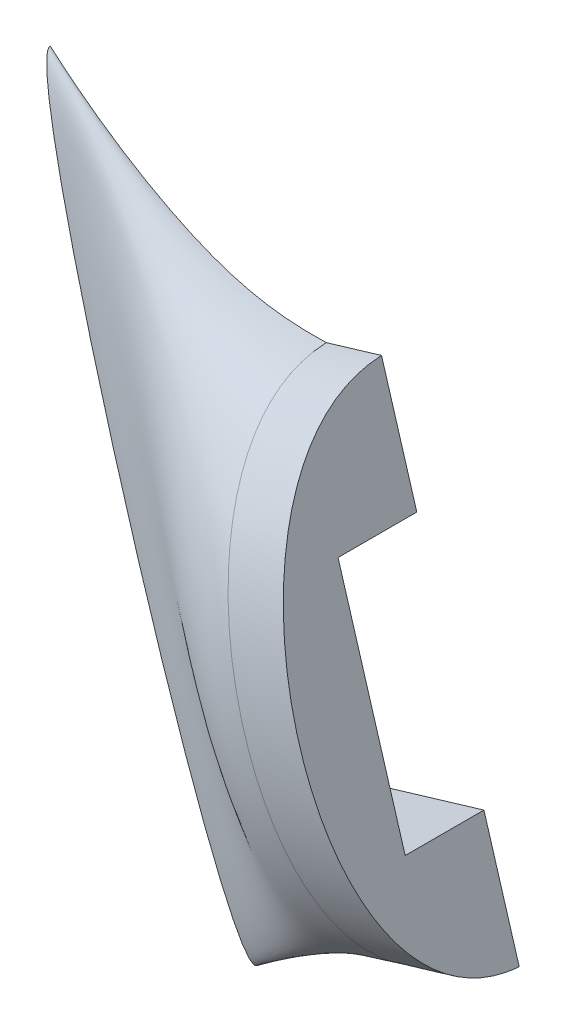
ISO-10303-21;
HEADER;
FILE_DESCRIPTION(('STEP AP214'),'2;1');
FILE_NAME('part.step','',(''),(''),'','','');
FILE_SCHEMA(('AUTOMOTIVE_DESIGN { 1 0 10303 214 1 1 1 1 }'));
ENDSEC;
DATA;
#1=APPLICATION_CONTEXT('core data for automotive mechanical design processes');
#2=APPLICATION_PROTOCOL_DEFINITION('international standard','automotive_design',2000,#1);
#3=PRODUCT_CONTEXT('',#1,'mechanical');
#4=PRODUCT('Part','Part','',(#3));
#5=PRODUCT_RELATED_PRODUCT_CATEGORY('part','',(#4));
#6=PRODUCT_DEFINITION_FORMATION('','',#4);
#7=PRODUCT_DEFINITION_CONTEXT('part definition',#1,'design');
#8=PRODUCT_DEFINITION('design','',#6,#7);
#9=PRODUCT_DEFINITION_SHAPE('','',#8);
#10=(LENGTH_UNIT() NAMED_UNIT(*) SI_UNIT(.MILLI.,.METRE.));
#11=(NAMED_UNIT(*) PLANE_ANGLE_UNIT() SI_UNIT($,.RADIAN.));
#12=(NAMED_UNIT(*) SI_UNIT($,.STERADIAN.) SOLID_ANGLE_UNIT());
#13=UNCERTAINTY_MEASURE_WITH_UNIT(LENGTH_MEASURE(1.E-05),#10,'distance_accuracy_value','');
#14=(GEOMETRIC_REPRESENTATION_CONTEXT(3) GLOBAL_UNCERTAINTY_ASSIGNED_CONTEXT((#13)) GLOBAL_UNIT_ASSIGNED_CONTEXT((#10,
#11,#12)) REPRESENTATION_CONTEXT('',''));
#15=CARTESIAN_POINT('',(0.,0.,0.));
#16=DIRECTION('',(0.,0.,1.));
#17=DIRECTION('',(1.,0.,0.));
#18=AXIS2_PLACEMENT_3D('',#15,#16,#17);
#19=CARTESIAN_POINT('',(68.8351354727939,20.5796630643947,0.));
#20=DIRECTION('',(0.,0.,1.));
#21=DIRECTION('',(-1.,0.,0.));
#22=AXIS2_PLACEMENT_3D('',#19,#20,#21);
#23=PLANE('',#22);
#24=DIRECTION('',(0.28644268795493,-0.958097378410543,0.));
#25=VECTOR('',#24,1.);
#26=CARTESIAN_POINT('',(75.1754818984992,-8.30803292728945,0.));
#27=LINE('',#26,#25);
#28=CARTESIAN_POINT('',(71.680881105449,3.38075508931917,0.));
#29=VERTEX_POINT('',#28);
#30=CARTESIAN_POINT('',(75.1754818984992,-8.30803292728945,0.));
#31=VERTEX_POINT('',#30);
#32=EDGE_CURVE('E115',#29,#31,#27,.T.);
#33=ORIENTED_EDGE('',*,*,#32,.T.);
#34=DIRECTION('',(0.958097378410543,0.28644268795493,0.));
#35=VECTOR('',#34,1.);
#36=CARTESIAN_POINT('',(75.1754818984992,-8.30803292728945,0.));
#37=LINE('',#36,#35);
#38=CARTESIAN_POINT('',(80.157588266234,-6.81853094992381,0.));
#39=VERTEX_POINT('',#38);
#40=EDGE_CURVE('E120',#31,#39,#37,.T.);
#41=ORIENTED_EDGE('',*,*,#40,.T.);
#42=DIRECTION('',(-0.28644268795493,0.958097378410543,0.));
#43=VECTOR('',#42,1.);
#44=CARTESIAN_POINT('',(71.7094276080255,21.4389911282595,0.));
#45=LINE('',#44,#43);
#46=CARTESIAN_POINT('',(81.9945436836104,-12.9628042850572,0.));
#47=VERTEX_POINT('',#46);
#48=EDGE_CURVE('E224',#47,#39,#45,.T.);
#49=ORIENTED_EDGE('',*,*,#48,.F.);
#50=DIRECTION('',(0.958097378410543,0.28644268795493,0.));
#51=VECTOR('',#50,1.);
#52=CARTESIAN_POINT('',(79.1202515483788,-13.822132348922,0.));
#53=LINE('',#52,#51);
#54=CARTESIAN_POINT('',(79.1202515483788,-13.822132348922,0.));
#55=VERTEX_POINT('',#54);
#56=EDGE_CURVE('E47',#55,#47,#53,.T.);
#57=ORIENTED_EDGE('',*,*,#56,.F.);
#58=CARTESIAN_POINT('',(79.1202515483788,-13.822132348922,0.));
#59=CARTESIAN_POINT('',(77.2430299362491,-14.4970734561594,0.));
#60=CARTESIAN_POINT('',(73.2538280253343,-16.3282447215019,0.));
#61=CARTESIAN_POINT('',(70.0691808052114,-18.4306839193362,0.));
#62=CARTESIAN_POINT('',(68.3594778518222,-19.7225480436874,0.));
#63=B_SPLINE_CURVE_WITH_KNOTS('',3,(#58,#59,#60,#61,#62),.UNSPECIFIED.,.F.,.F.,(4,1,4),(0.,
0.464218351567374,1.),.UNSPECIFIED.);
#64=CARTESIAN_POINT('',(68.3594778518222,-19.7225480436874,0.));
#65=VERTEX_POINT('',#64);
#66=EDGE_CURVE('E148',#55,#65,#63,.T.);
#67=ORIENTED_EDGE('',*,*,#66,.T.);
#68=DIRECTION('',(-0.286442687954896,0.958097378410553,0.));
#69=VECTOR('',#68,1.);
#70=CARTESIAN_POINT('',(68.3594778518222,-19.7225480436874,0.));
#71=LINE('',#70,#69);
#72=CARTESIAN_POINT('',(57.5775416453369,16.3410180657399,0.));
#73=VERTEX_POINT('',#72);
#74=EDGE_CURVE('E195',#65,#73,#71,.T.);
#75=ORIENTED_EDGE('',*,*,#74,.T.);
#76=CARTESIAN_POINT('',(71.9517399205758,10.1552023379534,0.));
#77=CARTESIAN_POINT('',(69.5938616061763,10.0813238258005,0.));
#78=CARTESIAN_POINT('',(65.4570985045668,10.7673698634453,0.));
#79=CARTESIAN_POINT('',(60.011062756017,14.2052009776582,0.));
#80=CARTESIAN_POINT('',(57.5775416453369,16.3410180657399,0.));
#81=B_SPLINE_CURVE_WITH_KNOTS('',3,(#76,#77,#78,#79,#80),.UNSPECIFIED.,.F.,.F.,(4,1,4),(0.,
0.464218351567374,1.),.UNSPECIFIED.);
#82=CARTESIAN_POINT('',(71.9517399205758,10.1552023379534,0.));
#83=VERTEX_POINT('',#82);
#84=EDGE_CURVE('E142',#73,#83,#81,.F.);
#85=ORIENTED_EDGE('',*,*,#84,.T.);
#86=DIRECTION('',(0.958097378410543,0.28644268795493,0.));
#87=VECTOR('',#86,1.);
#88=CARTESIAN_POINT('',(71.9517399205758,10.1552023379534,1.43136294104055E-13));
#89=LINE('',#88,#87);
#90=CARTESIAN_POINT('',(74.8260320558074,11.0145304018182,1.41892161006732E-13));
#91=VERTEX_POINT('',#90);
#92=EDGE_CURVE('E11',#83,#91,#89,.T.);
#93=ORIENTED_EDGE('',*,*,#92,.T.);
#94=CARTESIAN_POINT('',(76.6629874731838,4.87025706668481,0.));
#95=VERTEX_POINT('',#94);
#96=EDGE_CURVE('E208',#95,#91,#45,.T.);
#97=ORIENTED_EDGE('',*,*,#96,.F.);
#98=DIRECTION('',(0.958097378410543,0.28644268795493,0.));
#99=VECTOR('',#98,1.);
#100=CARTESIAN_POINT('',(71.680881105449,3.38075508931917,0.));
#101=LINE('',#100,#99);
#102=EDGE_CURVE('E130',#29,#95,#101,.T.);
#103=ORIENTED_EDGE('',*,*,#102,.F.);
#104=EDGE_LOOP('',(#33,#41,#49,#57,#67,#75,#85,#93,#97,#103));
#105=FACE_BOUND('',#104,.T.);
#106=ADVANCED_FACE('F37',(#105),#23,.F.);
#107=CARTESIAN_POINT('',(71.9517399205757,10.1552023379534,0.));
#108=CARTESIAN_POINT('',(72.0475401790211,9.83476833727146,10.4883470019911));
#109=CARTESIAN_POINT('',(78.9396589990728,-13.2180839464793,10.3872504791321));
#110=CARTESIAN_POINT('',(79.1202515483788,-13.822132348922,0.));
#111=B_SPLINE_CURVE_WITH_KNOTS('',3,(#107,#108,#109,#110),.UNSPECIFIED.,.F.,.F.,(4,4),(0.,1.),.UNSPECIFIED.);
#112=DIRECTION('',(0.958097378410543,0.28644268795493,0.));
#113=VECTOR('',#112,1.);
#114=SURFACE_OF_LINEAR_EXTRUSION('',#111,#113);
#115=CARTESIAN_POINT('',(74.8260320558074,11.0145304018182,0.));
#116=CARTESIAN_POINT('',(74.9218323142527,10.6940964011362,10.4883470019911));
#117=CARTESIAN_POINT('',(81.8139511343044,-12.3587558826145,10.3872504791321));
#118=CARTESIAN_POINT('',(81.9945436836104,-12.9628042850572,0.));
#119=B_SPLINE_CURVE_WITH_KNOTS('',3,(#115,#116,#117,#118),.UNSPECIFIED.,.F.,.F.,(4,4),(0.,1.),.UNSPECIFIED.);
#120=EDGE_CURVE('E74',#91,#47,#119,.T.);
#121=ORIENTED_EDGE('',*,*,#120,.F.);
#122=ORIENTED_EDGE('',*,*,#92,.F.);
#123=CARTESIAN_POINT('',(71.9517399205757,10.1552023379534,0.));
#124=CARTESIAN_POINT('',(72.0475401790211,9.83476833727146,10.4883470019911));
#125=CARTESIAN_POINT('',(78.9396589990728,-13.2180839464793,10.3872504791321));
#126=CARTESIAN_POINT('',(79.1202515483788,-13.822132348922,0.));
#127=B_SPLINE_CURVE_WITH_KNOTS('',3,(#123,#124,#125,#126),.UNSPECIFIED.,.F.,.F.,(4,4),(0.,1.),.UNSPECIFIED.);
#128=EDGE_CURVE('E64',#83,#55,#127,.T.);
#129=ORIENTED_EDGE('',*,*,#128,.T.);
#130=ORIENTED_EDGE('',*,*,#56,.T.);
#131=EDGE_LOOP('',(#121,#122,#129,#130));
#132=FACE_BOUND('',#131,.T.);
#133=ADVANCED_FACE('F229',(#132),#114,.T.);
#134=CARTESIAN_POINT('',(71.7094276080255,21.4389911282595,0.));
#135=DIRECTION('',(-0.958097378410543,-0.28644268795493,0.));
#136=DIRECTION('',(0.28644268795493,-0.958097378410543,0.));
#137=AXIS2_PLACEMENT_3D('',#134,#135,#136);
#138=PLANE('',#137);
#139=ORIENTED_EDGE('',*,*,#96,.T.);
#140=ORIENTED_EDGE('',*,*,#120,.T.);
#141=ORIENTED_EDGE('',*,*,#48,.T.);
#142=DIRECTION('',(0.,0.,1.));
#143=VECTOR('',#142,1.);
#144=CARTESIAN_POINT('',(80.157588266234,-6.81853094992381,4.09999999999998));
#145=LINE('',#144,#143);
#146=CARTESIAN_POINT('',(80.157588266234,-6.81853094992381,4.09999999999998));
#147=VERTEX_POINT('',#146);
#148=EDGE_CURVE('E55',#39,#147,#145,.T.);
#149=ORIENTED_EDGE('',*,*,#148,.T.);
#150=DIRECTION('',(-0.28644268795493,0.958097378410543,0.));
#151=VECTOR('',#150,1.);
#152=CARTESIAN_POINT('',(76.6629874731838,4.87025706668481,4.09999999999997));
#153=LINE('',#152,#151);
#154=CARTESIAN_POINT('',(76.6629874731838,4.87025706668481,4.09999999999997));
#155=VERTEX_POINT('',#154);
#156=EDGE_CURVE('E133',#147,#155,#153,.T.);
#157=ORIENTED_EDGE('',*,*,#156,.T.);
#158=DIRECTION('',(0.,0.,-1.));
#159=VECTOR('',#158,1.);
#160=CARTESIAN_POINT('',(76.6629874731838,4.87025706668481,0.));
#161=LINE('',#160,#159);
#162=EDGE_CURVE('E131',#155,#95,#161,.T.);
#163=ORIENTED_EDGE('',*,*,#162,.T.);
#164=EDGE_LOOP('',(#139,#140,#141,#149,#157,#163));
#165=FACE_BOUND('',#164,.T.);
#166=ADVANCED_FACE('F232',(#165),#138,.F.);
#167=CARTESIAN_POINT('',(62.9685097485796,-1.69076498897374,1.27791279282259));
#168=DIRECTION('',(0.958097378410553,0.286442687954896,0.));
#169=DIRECTION('',(-0.286442687954896,0.958097378410553,0.));
#170=AXIS2_PLACEMENT_3D('',#167,#168,#169);
#171=PLANE('',#170);
#172=CARTESIAN_POINT('',(57.5775416453369,16.3410180657399,0.));
#173=CARTESIAN_POINT('',(57.5775416453369,16.3410180657399,1.70388372376346));
#174=CARTESIAN_POINT('',(68.3594778518222,-19.7225480436874,1.70388372376348));
#175=CARTESIAN_POINT('',(68.3594778518222,-19.7225480436874,0.));
#176=B_SPLINE_CURVE_WITH_KNOTS('',3,(#172,#173,#174,#175),.UNSPECIFIED.,.F.,.F.,(4,4),(0.,1.),.UNSPECIFIED.);
#177=EDGE_CURVE('E81',#73,#65,#176,.T.);
#178=ORIENTED_EDGE('',*,*,#177,.F.);
#179=ORIENTED_EDGE('',*,*,#74,.F.);
#180=EDGE_LOOP('',(#178,#179));
#181=FACE_BOUND('',#180,.T.);
#182=ADVANCED_FACE('F175',(#181),#171,.F.);
#183=CARTESIAN_POINT('',(71.9517399205758,10.1552023379534,0.));
#184=CARTESIAN_POINT('',(69.5938616061763,10.0813238258005,0.));
#185=CARTESIAN_POINT('',(65.4570985045668,10.7673698634453,0.));
#186=CARTESIAN_POINT('',(60.011062756017,14.2052009776582,0.));
#187=CARTESIAN_POINT('',(57.5775416453369,16.3410180657399,0.));
#188=CARTESIAN_POINT('',(72.0475401790211,9.83476833727144,10.4883470019911));
#189=CARTESIAN_POINT('',(69.8498807653782,9.56053562675707,10.4883470019911));
#190=CARTESIAN_POINT('',(65.4138783339914,10.5729305449382,6.19197021566485));
#191=CARTESIAN_POINT('',(59.76979003692,15.3477613818025,1.70388372376346));
#192=CARTESIAN_POINT('',(57.5775416453369,16.3410180657399,1.70388372376346));
#193=CARTESIAN_POINT('',(78.9396589990728,-13.2180839464794,10.3872504791321));
#194=CARTESIAN_POINT('',(76.9022184861865,-13.6926708553552,10.3872504791321));
#195=CARTESIAN_POINT('',(73.3459800759381,-16.2974734173909,6.25031093128427));
#196=CARTESIAN_POINT('',(70.3104535243084,-19.5732443234805,1.70388372376347));
#197=CARTESIAN_POINT('',(68.3594778518222,-19.7225480436874,1.70388372376348));
#198=CARTESIAN_POINT('',(79.1202515483788,-13.822132348922,0.));
#199=CARTESIAN_POINT('',(77.2430299362491,-14.4970734561594,0.));
#200=CARTESIAN_POINT('',(73.2538280253343,-16.3282447215019,0.));
#201=CARTESIAN_POINT('',(70.0691808052114,-18.4306839193362,0.));
#202=CARTESIAN_POINT('',(68.3594778518222,-19.7225480436874,0.));
#203=B_SPLINE_SURFACE_WITH_KNOTS('',3,3,((#183,#184,#185,#186,#187),(#188,#189,#190,#191,#192),
(#193,#194,#195,#196,#197),(#198,#199,#200,#201,#202)),.UNSPECIFIED.,.F.,.F.,.F.,(4,4),(4,1,4),
(0.,1.),(0.,0.464218351567374,1.),.UNSPECIFIED.);
#204=ORIENTED_EDGE('',*,*,#128,.F.);
#205=ORIENTED_EDGE('',*,*,#84,.F.);
#206=ORIENTED_EDGE('',*,*,#177,.T.);
#207=ORIENTED_EDGE('',*,*,#66,.F.);
#208=EDGE_LOOP('',(#204,#205,#206,#207));
#209=FACE_BOUND('',#208,.T.);
#210=ADVANCED_FACE('F162',(#209),#203,.F.);
#211=CARTESIAN_POINT('',(71.680881105449,3.38075508931917,0.));
#212=DIRECTION('',(-0.28644268795493,0.958097378410543,0.));
#213=DIRECTION('',(-0.958097378410543,-0.28644268795493,0.));
#214=AXIS2_PLACEMENT_3D('',#211,#212,#213);
#215=PLANE('',#214);
#216=ORIENTED_EDGE('',*,*,#162,.F.);
#217=DIRECTION('',(0.958097378410543,0.28644268795493,0.));
#218=VECTOR('',#217,1.);
#219=CARTESIAN_POINT('',(71.680881105449,3.38075508931917,4.09999999999998));
#220=LINE('',#219,#218);
#221=CARTESIAN_POINT('',(71.680881105449,3.38075508931917,4.09999999999998));
#222=VERTEX_POINT('',#221);
#223=EDGE_CURVE('E143',#222,#155,#220,.T.);
#224=ORIENTED_EDGE('',*,*,#223,.F.);
#225=DIRECTION('',(0.,0.,-1.));
#226=VECTOR('',#225,1.);
#227=CARTESIAN_POINT('',(71.680881105449,3.38075508931917,0.));
#228=LINE('',#227,#226);
#229=EDGE_CURVE('E125',#222,#29,#228,.T.);
#230=ORIENTED_EDGE('',*,*,#229,.T.);
#231=ORIENTED_EDGE('',*,*,#102,.T.);
#232=EDGE_LOOP('',(#216,#224,#230,#231));
#233=FACE_BOUND('',#232,.T.);
#234=ADVANCED_FACE('F174',(#233),#215,.F.);
#235=CARTESIAN_POINT('',(71.680881105449,3.38075508931917,4.09999999999998));
#236=DIRECTION('',(0.,0.,1.));
#237=DIRECTION('',(-1.,0.,0.));
#238=AXIS2_PLACEMENT_3D('',#235,#236,#237);
#239=PLANE('',#238);
#240=ORIENTED_EDGE('',*,*,#156,.F.);
#241=DIRECTION('',(0.958097378410543,0.28644268795493,0.));
#242=VECTOR('',#241,1.);
#243=CARTESIAN_POINT('',(75.1754818984992,-8.30803292728944,4.09999999999998));
#244=LINE('',#243,#242);
#245=CARTESIAN_POINT('',(75.1754818984992,-8.30803292728944,4.09999999999998));
#246=VERTEX_POINT('',#245);
#247=EDGE_CURVE('E124',#246,#147,#244,.T.);
#248=ORIENTED_EDGE('',*,*,#247,.F.);
#249=DIRECTION('',(-0.28644268795493,0.958097378410543,0.));
#250=VECTOR('',#249,1.);
#251=CARTESIAN_POINT('',(71.680881105449,3.38075508931917,4.09999999999998));
#252=LINE('',#251,#250);
#253=EDGE_CURVE('E116',#246,#222,#252,.T.);
#254=ORIENTED_EDGE('',*,*,#253,.T.);
#255=ORIENTED_EDGE('',*,*,#223,.T.);
#256=EDGE_LOOP('',(#240,#248,#254,#255));
#257=FACE_BOUND('',#256,.T.);
#258=ADVANCED_FACE('F279',(#257),#239,.F.);
#259=CARTESIAN_POINT('',(75.1754818984992,-8.30803292728944,4.09999999999998));
#260=DIRECTION('',(0.28644268795493,-0.958097378410543,0.));
#261=DIRECTION('',(0.958097378410543,0.28644268795493,0.));
#262=AXIS2_PLACEMENT_3D('',#259,#260,#261);
#263=PLANE('',#262);
#264=ORIENTED_EDGE('',*,*,#148,.F.);
#265=ORIENTED_EDGE('',*,*,#40,.F.);
#266=DIRECTION('',(0.,0.,1.));
#267=VECTOR('',#266,1.);
#268=CARTESIAN_POINT('',(75.1754818984992,-8.30803292728944,4.09999999999998));
#269=LINE('',#268,#267);
#270=EDGE_CURVE('E111',#31,#246,#269,.T.);
#271=ORIENTED_EDGE('',*,*,#270,.T.);
#272=ORIENTED_EDGE('',*,*,#247,.T.);
#273=EDGE_LOOP('',(#264,#265,#271,#272));
#274=FACE_BOUND('',#273,.T.);
#275=ADVANCED_FACE('F121',(#274),#263,.F.);
#276=CARTESIAN_POINT('',(66.7273212402907,19.9494891508938,0.));
#277=DIRECTION('',(-0.958097378410543,-0.28644268795493,0.));
#278=DIRECTION('',(0.28644268795493,-0.958097378410543,0.));
#279=AXIS2_PLACEMENT_3D('',#276,#277,#278);
#280=PLANE('',#279);
#281=ORIENTED_EDGE('',*,*,#32,.F.);
#282=ORIENTED_EDGE('',*,*,#229,.F.);
#283=ORIENTED_EDGE('',*,*,#253,.F.);
#284=ORIENTED_EDGE('',*,*,#270,.F.);
#285=EDGE_LOOP('',(#281,#282,#283,#284));
#286=FACE_BOUND('',#285,.T.);
#287=ADVANCED_FACE('F112',(#286),#280,.F.);
#288=CLOSED_SHELL('',(#106,#133,#166,#182,#210,#234,#258,#275,#287));
#289=MANIFOLD_SOLID_BREP('B2',#288);
#290=ADVANCED_BREP_SHAPE_REPRESENTATION('',(#18,#289),#14);
#291=SHAPE_DEFINITION_REPRESENTATION(#9,#290);
ENDSEC;
END-ISO-10303-21;
